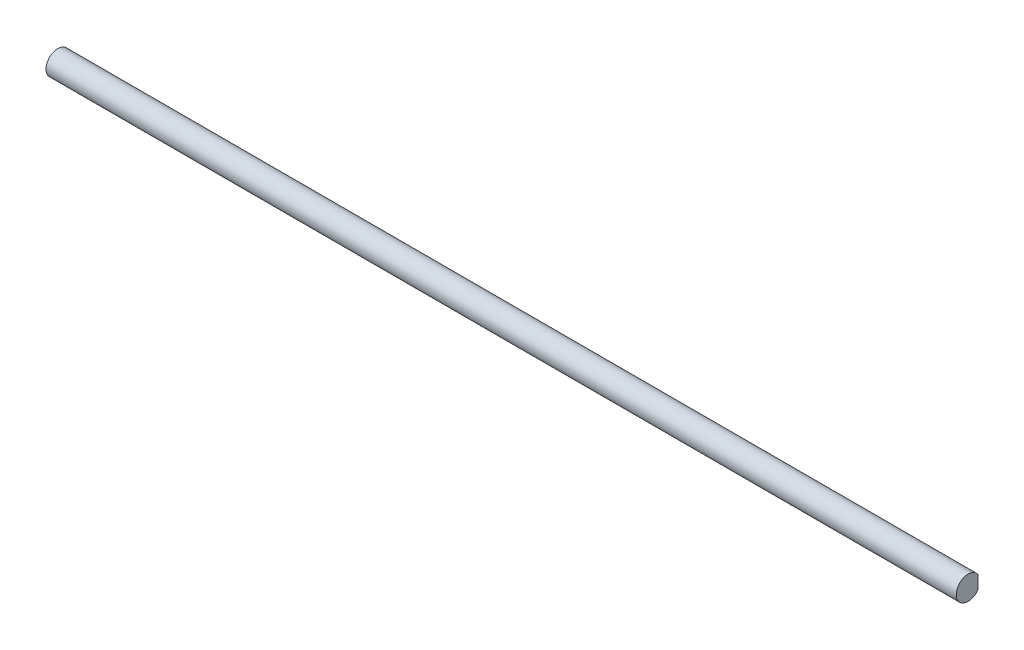
ISO-10303-21;
HEADER;
FILE_DESCRIPTION(('STEP AP214'),'2;1');
FILE_NAME('part.step','',(''),(''),'','','');
FILE_SCHEMA(('AUTOMOTIVE_DESIGN { 1 0 10303 214 1 1 1 1 }'));
ENDSEC;
DATA;
#1=APPLICATION_CONTEXT('core data for automotive mechanical design processes');
#2=APPLICATION_PROTOCOL_DEFINITION('international standard','automotive_design',2000,#1);
#3=PRODUCT_CONTEXT('',#1,'mechanical');
#4=PRODUCT('Part','Part','',(#3));
#5=PRODUCT_RELATED_PRODUCT_CATEGORY('part','',(#4));
#6=PRODUCT_DEFINITION_FORMATION('','',#4);
#7=PRODUCT_DEFINITION_CONTEXT('part definition',#1,'design');
#8=PRODUCT_DEFINITION('design','',#6,#7);
#9=PRODUCT_DEFINITION_SHAPE('','',#8);
#10=(LENGTH_UNIT() NAMED_UNIT(*) SI_UNIT(.MILLI.,.METRE.));
#11=(NAMED_UNIT(*) PLANE_ANGLE_UNIT() SI_UNIT($,.RADIAN.));
#12=(NAMED_UNIT(*) SI_UNIT($,.STERADIAN.) SOLID_ANGLE_UNIT());
#13=UNCERTAINTY_MEASURE_WITH_UNIT(LENGTH_MEASURE(1.E-05),#10,'distance_accuracy_value','');
#14=(GEOMETRIC_REPRESENTATION_CONTEXT(3) GLOBAL_UNCERTAINTY_ASSIGNED_CONTEXT((#13)) GLOBAL_UNIT_ASSIGNED_CONTEXT((#10,
#11,#12)) REPRESENTATION_CONTEXT('',''));
#15=CARTESIAN_POINT('',(0.,0.,0.));
#16=DIRECTION('',(0.,0.,1.));
#17=DIRECTION('',(1.,0.,0.));
#18=AXIS2_PLACEMENT_3D('',#15,#16,#17);
#19=CARTESIAN_POINT('',(460.,0.,0.));
#20=DIRECTION('',(-1.,0.,0.));
#21=DIRECTION('',(0.,0.,1.));
#22=AXIS2_PLACEMENT_3D('',#19,#20,#21);
#23=CYLINDRICAL_SURFACE('',#22,6.);
#24=CARTESIAN_POINT('',(120.5,0.,0.));
#25=DIRECTION('',(1.,0.,0.));
#26=DIRECTION('',(0.,0.,-1.));
#27=AXIS2_PLACEMENT_3D('',#24,#25,#26);
#28=CIRCLE('',#27,6.);
#29=CARTESIAN_POINT('',(120.5,-3.31662479035541,-5.));
#30=VERTEX_POINT('',#29);
#31=CARTESIAN_POINT('',(120.5,3.31662479035541,-5.));
#32=VERTEX_POINT('',#31);
#33=EDGE_CURVE('E11',#30,#32,#28,.T.);
#34=ORIENTED_EDGE('',*,*,#33,.T.);
#35=DIRECTION('',(-1.,0.,0.));
#36=VECTOR('',#35,1.);
#37=CARTESIAN_POINT('',(460.,3.3166247903554,-5.));
#38=LINE('',#37,#36);
#39=CARTESIAN_POINT('',(104.,3.3166247903554,-5.));
#40=VERTEX_POINT('',#39);
#41=EDGE_CURVE('E51',#32,#40,#38,.T.);
#42=ORIENTED_EDGE('',*,*,#41,.T.);
#43=CARTESIAN_POINT('',(104.,0.,0.));
#44=DIRECTION('',(-1.,0.,0.));
#45=DIRECTION('',(0.,0.,1.));
#46=AXIS2_PLACEMENT_3D('',#43,#44,#45);
#47=CIRCLE('',#46,6.);
#48=CARTESIAN_POINT('',(104.,-3.3166247903554,-5.));
#49=VERTEX_POINT('',#48);
#50=EDGE_CURVE('E94',#40,#49,#47,.T.);
#51=ORIENTED_EDGE('',*,*,#50,.T.);
#52=DIRECTION('',(-1.,0.,0.));
#53=VECTOR('',#52,1.);
#54=CARTESIAN_POINT('',(460.,-3.3166247903554,-5.));
#55=LINE('',#54,#53);
#56=EDGE_CURVE('E100',#49,#30,#55,.F.);
#57=ORIENTED_EDGE('',*,*,#56,.T.);
#58=EDGE_LOOP('',(#34,#42,#51,#57));
#59=FACE_BOUND('',#58,.T.);
#60=CARTESIAN_POINT('',(15.5,0.,0.));
#61=DIRECTION('',(1.,0.,0.));
#62=DIRECTION('',(0.,0.,-1.));
#63=AXIS2_PLACEMENT_3D('',#60,#61,#62);
#64=CIRCLE('',#63,6.);
#65=CARTESIAN_POINT('',(15.5,-3.3166247903553,-5.));
#66=VERTEX_POINT('',#65);
#67=CARTESIAN_POINT('',(15.5,3.3166247903553,-5.));
#68=VERTEX_POINT('',#67);
#69=EDGE_CURVE('E121',#66,#68,#64,.T.);
#70=ORIENTED_EDGE('',*,*,#69,.T.);
#71=DIRECTION('',(-1.,0.,0.));
#72=VECTOR('',#71,1.);
#73=CARTESIAN_POINT('',(460.,3.31662479035529,-5.00000000000008));
#74=LINE('',#73,#72);
#75=CARTESIAN_POINT('',(0.,3.31662479035541,-5.));
#76=VERTEX_POINT('',#75);
#77=EDGE_CURVE('E133',#68,#76,#74,.T.);
#78=ORIENTED_EDGE('',*,*,#77,.T.);
#79=CARTESIAN_POINT('',(0.,0.,0.));
#80=DIRECTION('',(1.,0.,0.));
#81=DIRECTION('',(0.,0.,-1.));
#82=AXIS2_PLACEMENT_3D('',#79,#80,#81);
#83=CIRCLE('',#82,6.);
#84=CARTESIAN_POINT('',(0.,-3.3166247903554,-5.));
#85=VERTEX_POINT('',#84);
#86=EDGE_CURVE('E129',#76,#85,#83,.T.);
#87=ORIENTED_EDGE('',*,*,#86,.T.);
#88=DIRECTION('',(-1.,0.,0.));
#89=VECTOR('',#88,1.);
#90=CARTESIAN_POINT('',(460.,-3.31662479035529,-5.00000000000008));
#91=LINE('',#90,#89);
#92=EDGE_CURVE('E140',#85,#66,#91,.F.);
#93=ORIENTED_EDGE('',*,*,#92,.T.);
#94=EDGE_LOOP('',(#70,#78,#87,#93));
#95=FACE_BOUND('',#94,.T.);
#96=DIRECTION('',(-1.,0.,0.));
#97=VECTOR('',#96,1.);
#98=CARTESIAN_POINT('',(460.,3.3166247903554,-5.));
#99=LINE('',#98,#97);
#100=CARTESIAN_POINT('',(444.5,3.3166247903554,-5.));
#101=VERTEX_POINT('',#100);
#102=CARTESIAN_POINT('',(460.,3.3166247903554,-5.));
#103=VERTEX_POINT('',#102);
#104=EDGE_CURVE('E65',#101,#103,#99,.F.);
#105=ORIENTED_EDGE('',*,*,#104,.F.);
#106=CARTESIAN_POINT('',(444.5,0.,0.));
#107=DIRECTION('',(1.,0.,0.));
#108=DIRECTION('',(0.,0.,-1.));
#109=AXIS2_PLACEMENT_3D('',#106,#107,#108);
#110=CIRCLE('',#109,6.);
#111=CARTESIAN_POINT('',(444.5,-3.3166247903554,-5.));
#112=VERTEX_POINT('',#111);
#113=EDGE_CURVE('E101',#112,#101,#110,.T.);
#114=ORIENTED_EDGE('',*,*,#113,.F.);
#115=DIRECTION('',(-1.,0.,0.));
#116=VECTOR('',#115,1.);
#117=CARTESIAN_POINT('',(460.,-3.3166247903554,-5.));
#118=LINE('',#117,#116);
#119=CARTESIAN_POINT('',(460.,-3.31662479035541,-5.));
#120=VERTEX_POINT('',#119);
#121=EDGE_CURVE('E148',#120,#112,#118,.T.);
#122=ORIENTED_EDGE('',*,*,#121,.F.);
#123=CARTESIAN_POINT('',(460.,0.,0.));
#124=DIRECTION('',(1.,0.,0.));
#125=DIRECTION('',(0.,0.,-1.));
#126=AXIS2_PLACEMENT_3D('',#123,#124,#125);
#127=CIRCLE('',#126,6.);
#128=EDGE_CURVE('E128',#103,#120,#127,.T.);
#129=ORIENTED_EDGE('',*,*,#128,.F.);
#130=EDGE_LOOP('',(#105,#114,#122,#129));
#131=FACE_BOUND('',#130,.T.);
#132=ADVANCED_FACE('F43',(#59,#95,#131),#23,.T.);
#133=CARTESIAN_POINT('',(460.,0.,0.));
#134=DIRECTION('',(1.,0.,0.));
#135=DIRECTION('',(0.,0.,-1.));
#136=AXIS2_PLACEMENT_3D('',#133,#134,#135);
#137=PLANE('',#136);
#138=ORIENTED_EDGE('',*,*,#128,.T.);
#139=DIRECTION('',(0.,1.,0.));
#140=VECTOR('',#139,1.);
#141=CARTESIAN_POINT('',(460.,0.,-5.));
#142=LINE('',#141,#140);
#143=EDGE_CURVE('E118',#120,#103,#142,.T.);
#144=ORIENTED_EDGE('',*,*,#143,.T.);
#145=EDGE_LOOP('',(#138,#144));
#146=FACE_BOUND('',#145,.T.);
#147=ADVANCED_FACE('F170',(#146),#137,.T.);
#148=CARTESIAN_POINT('',(0.,0.,0.));
#149=DIRECTION('',(1.,0.,0.));
#150=DIRECTION('',(0.,0.,-1.));
#151=AXIS2_PLACEMENT_3D('',#148,#149,#150);
#152=PLANE('',#151);
#153=ORIENTED_EDGE('',*,*,#86,.F.);
#154=DIRECTION('',(0.,-1.,0.));
#155=VECTOR('',#154,1.);
#156=CARTESIAN_POINT('',(0.,0.,-5.));
#157=LINE('',#156,#155);
#158=EDGE_CURVE('E124',#76,#85,#157,.T.);
#159=ORIENTED_EDGE('',*,*,#158,.T.);
#160=EDGE_LOOP('',(#153,#159));
#161=FACE_BOUND('',#160,.T.);
#162=ADVANCED_FACE('F174',(#161),#152,.F.);
#163=CARTESIAN_POINT('',(15.5,-200.,-6.));
#164=DIRECTION('',(1.,0.,0.));
#165=DIRECTION('',(0.,0.,-1.));
#166=AXIS2_PLACEMENT_3D('',#163,#164,#165);
#167=PLANE('',#166);
#168=ORIENTED_EDGE('',*,*,#69,.F.);
#169=DIRECTION('',(0.,1.,0.));
#170=VECTOR('',#169,1.);
#171=CARTESIAN_POINT('',(15.5,-200.,-5.));
#172=LINE('',#171,#170);
#173=EDGE_CURVE('E144',#66,#68,#172,.T.);
#174=ORIENTED_EDGE('',*,*,#173,.T.);
#175=EDGE_LOOP('',(#168,#174));
#176=FACE_BOUND('',#175,.T.);
#177=ADVANCED_FACE('F180',(#176),#167,.F.);
#178=CARTESIAN_POINT('',(15.5,-200.,-5.));
#179=DIRECTION('',(0.,0.,1.));
#180=DIRECTION('',(1.,0.,0.));
#181=AXIS2_PLACEMENT_3D('',#178,#179,#180);
#182=PLANE('',#181);
#183=ORIENTED_EDGE('',*,*,#173,.F.);
#184=ORIENTED_EDGE('',*,*,#92,.F.);
#185=ORIENTED_EDGE('',*,*,#158,.F.);
#186=ORIENTED_EDGE('',*,*,#77,.F.);
#187=EDGE_LOOP('',(#183,#184,#185,#186));
#188=FACE_BOUND('',#187,.T.);
#189=ADVANCED_FACE('F183',(#188),#182,.F.);
#190=CARTESIAN_POINT('',(444.5,-200.,-6.));
#191=DIRECTION('',(1.,0.,0.));
#192=DIRECTION('',(0.,0.,-1.));
#193=AXIS2_PLACEMENT_3D('',#190,#191,#192);
#194=PLANE('',#193);
#195=ORIENTED_EDGE('',*,*,#113,.T.);
#196=DIRECTION('',(0.,1.,0.));
#197=VECTOR('',#196,1.);
#198=CARTESIAN_POINT('',(444.5,-200.,-5.));
#199=LINE('',#198,#197);
#200=EDGE_CURVE('E153',#112,#101,#199,.T.);
#201=ORIENTED_EDGE('',*,*,#200,.F.);
#202=EDGE_LOOP('',(#195,#201));
#203=FACE_BOUND('',#202,.T.);
#204=ADVANCED_FACE('F167',(#203),#194,.T.);
#205=CARTESIAN_POINT('',(444.5,-200.,-5.));
#206=DIRECTION('',(0.,0.,-1.));
#207=DIRECTION('',(-1.,0.,0.));
#208=AXIS2_PLACEMENT_3D('',#205,#206,#207);
#209=PLANE('',#208);
#210=ORIENTED_EDGE('',*,*,#121,.T.);
#211=ORIENTED_EDGE('',*,*,#200,.T.);
#212=ORIENTED_EDGE('',*,*,#104,.T.);
#213=ORIENTED_EDGE('',*,*,#143,.F.);
#214=EDGE_LOOP('',(#210,#211,#212,#213));
#215=FACE_BOUND('',#214,.T.);
#216=ADVANCED_FACE('F160',(#215),#209,.T.);
#217=CARTESIAN_POINT('',(120.5,-200.,-5.));
#218=DIRECTION('',(1.,0.,0.));
#219=DIRECTION('',(0.,0.,-1.));
#220=AXIS2_PLACEMENT_3D('',#217,#218,#219);
#221=PLANE('',#220);
#222=ORIENTED_EDGE('',*,*,#33,.F.);
#223=DIRECTION('',(0.,1.,0.));
#224=VECTOR('',#223,1.);
#225=CARTESIAN_POINT('',(120.5,-200.,-5.));
#226=LINE('',#225,#224);
#227=EDGE_CURVE('E109',#30,#32,#226,.T.);
#228=ORIENTED_EDGE('',*,*,#227,.T.);
#229=EDGE_LOOP('',(#222,#228));
#230=FACE_BOUND('',#229,.T.);
#231=ADVANCED_FACE('F158',(#230),#221,.F.);
#232=CARTESIAN_POINT('',(104.,-200.,-5.));
#233=DIRECTION('',(0.,0.,1.));
#234=DIRECTION('',(1.,0.,0.));
#235=AXIS2_PLACEMENT_3D('',#232,#233,#234);
#236=PLANE('',#235);
#237=ORIENTED_EDGE('',*,*,#227,.F.);
#238=ORIENTED_EDGE('',*,*,#56,.F.);
#239=DIRECTION('',(0.,1.,0.));
#240=VECTOR('',#239,1.);
#241=CARTESIAN_POINT('',(104.,-200.,-5.));
#242=LINE('',#241,#240);
#243=EDGE_CURVE('E57',#49,#40,#242,.T.);
#244=ORIENTED_EDGE('',*,*,#243,.T.);
#245=ORIENTED_EDGE('',*,*,#41,.F.);
#246=EDGE_LOOP('',(#237,#238,#244,#245));
#247=FACE_BOUND('',#246,.T.);
#248=ADVANCED_FACE('F106',(#247),#236,.F.);
#249=CARTESIAN_POINT('',(104.,-200.,-6.));
#250=DIRECTION('',(-1.,0.,0.));
#251=DIRECTION('',(0.,0.,1.));
#252=AXIS2_PLACEMENT_3D('',#249,#250,#251);
#253=PLANE('',#252);
#254=ORIENTED_EDGE('',*,*,#243,.F.);
#255=ORIENTED_EDGE('',*,*,#50,.F.);
#256=EDGE_LOOP('',(#254,#255));
#257=FACE_BOUND('',#256,.T.);
#258=ADVANCED_FACE('F95',(#257),#253,.F.);
#259=CLOSED_SHELL('',(#132,#147,#162,#177,#189,#204,#216,#231,#248,#258));
#260=MANIFOLD_SOLID_BREP('B2',#259);
#261=ADVANCED_BREP_SHAPE_REPRESENTATION('',(#18,#260),#14);
#262=SHAPE_DEFINITION_REPRESENTATION(#9,#261);
ENDSEC;
END-ISO-10303-21;
